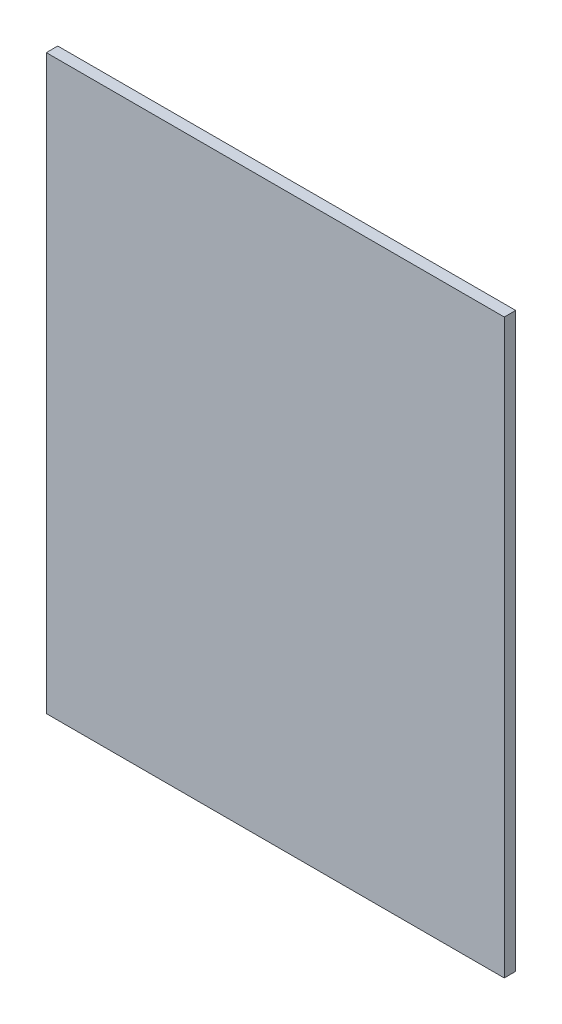
ISO-10303-21;
HEADER;
FILE_DESCRIPTION(('STEP AP214'),'2;1');
FILE_NAME('part.step','',(''),(''),'','','');
FILE_SCHEMA(('AUTOMOTIVE_DESIGN { 1 0 10303 214 1 1 1 1 }'));
ENDSEC;
DATA;
#1=APPLICATION_CONTEXT('core data for automotive mechanical design processes');
#2=APPLICATION_PROTOCOL_DEFINITION('international standard','automotive_design',2000,#1);
#3=PRODUCT_CONTEXT('',#1,'mechanical');
#4=PRODUCT('Part','Part','',(#3));
#5=PRODUCT_RELATED_PRODUCT_CATEGORY('part','',(#4));
#6=PRODUCT_DEFINITION_FORMATION('','',#4);
#7=PRODUCT_DEFINITION_CONTEXT('part definition',#1,'design');
#8=PRODUCT_DEFINITION('design','',#6,#7);
#9=PRODUCT_DEFINITION_SHAPE('','',#8);
#10=(LENGTH_UNIT() NAMED_UNIT(*) SI_UNIT(.MILLI.,.METRE.));
#11=(NAMED_UNIT(*) PLANE_ANGLE_UNIT() SI_UNIT($,.RADIAN.));
#12=(NAMED_UNIT(*) SI_UNIT($,.STERADIAN.) SOLID_ANGLE_UNIT());
#13=UNCERTAINTY_MEASURE_WITH_UNIT(LENGTH_MEASURE(1.E-05),#10,'distance_accuracy_value','');
#14=(GEOMETRIC_REPRESENTATION_CONTEXT(3) GLOBAL_UNCERTAINTY_ASSIGNED_CONTEXT((#13)) GLOBAL_UNIT_ASSIGNED_CONTEXT((#10,
#11,#12)) REPRESENTATION_CONTEXT('',''));
#15=CARTESIAN_POINT('',(0.,0.,0.));
#16=DIRECTION('',(0.,0.,1.));
#17=DIRECTION('',(1.,0.,0.));
#18=AXIS2_PLACEMENT_3D('',#15,#16,#17);
#19=CARTESIAN_POINT('',(0.,0.,3.));
#20=DIRECTION('',(1.,0.,0.));
#21=DIRECTION('',(0.,0.,-1.));
#22=AXIS2_PLACEMENT_3D('',#19,#20,#21);
#23=PLANE('',#22);
#24=DIRECTION('',(0.,-1.,0.));
#25=VECTOR('',#24,1.);
#26=CARTESIAN_POINT('',(0.,0.,0.));
#27=LINE('',#26,#25);
#28=CARTESIAN_POINT('',(0.,150.,0.));
#29=VERTEX_POINT('',#28);
#30=CARTESIAN_POINT('',(0.,0.,0.));
#31=VERTEX_POINT('',#30);
#32=EDGE_CURVE('E96',#29,#31,#27,.T.);
#33=ORIENTED_EDGE('',*,*,#32,.T.);
#34=DIRECTION('',(0.,0.,-1.));
#35=VECTOR('',#34,1.);
#36=CARTESIAN_POINT('',(0.,0.,3.));
#37=LINE('',#36,#35);
#38=CARTESIAN_POINT('',(0.,0.,3.));
#39=VERTEX_POINT('',#38);
#40=EDGE_CURVE('E11',#39,#31,#37,.T.);
#41=ORIENTED_EDGE('',*,*,#40,.F.);
#42=DIRECTION('',(0.,-1.,0.));
#43=VECTOR('',#42,1.);
#44=CARTESIAN_POINT('',(0.,0.,3.));
#45=LINE('',#44,#43);
#46=CARTESIAN_POINT('',(0.,150.,3.));
#47=VERTEX_POINT('',#46);
#48=EDGE_CURVE('E84',#47,#39,#45,.T.);
#49=ORIENTED_EDGE('',*,*,#48,.F.);
#50=DIRECTION('',(0.,0.,-1.));
#51=VECTOR('',#50,1.);
#52=CARTESIAN_POINT('',(0.,150.,3.));
#53=LINE('',#52,#51);
#54=EDGE_CURVE('E92',#47,#29,#53,.T.);
#55=ORIENTED_EDGE('',*,*,#54,.T.);
#56=EDGE_LOOP('',(#33,#41,#49,#55));
#57=FACE_BOUND('',#56,.T.);
#58=ADVANCED_FACE('F33',(#57),#23,.F.);
#59=CARTESIAN_POINT('',(0.,0.,3.));
#60=DIRECTION('',(0.,1.,0.));
#61=DIRECTION('',(0.,0.,1.));
#62=AXIS2_PLACEMENT_3D('',#59,#60,#61);
#63=PLANE('',#62);
#64=DIRECTION('',(1.,0.,0.));
#65=VECTOR('',#64,1.);
#66=CARTESIAN_POINT('',(0.,0.,0.));
#67=LINE('',#66,#65);
#68=CARTESIAN_POINT('',(120.,0.,0.));
#69=VERTEX_POINT('',#68);
#70=EDGE_CURVE('E88',#31,#69,#67,.T.);
#71=ORIENTED_EDGE('',*,*,#70,.T.);
#72=DIRECTION('',(0.,0.,-1.));
#73=VECTOR('',#72,1.);
#74=CARTESIAN_POINT('',(120.,0.,3.));
#75=LINE('',#74,#73);
#76=CARTESIAN_POINT('',(120.,0.,3.));
#77=VERTEX_POINT('',#76);
#78=EDGE_CURVE('E41',#77,#69,#75,.T.);
#79=ORIENTED_EDGE('',*,*,#78,.F.);
#80=DIRECTION('',(1.,0.,0.));
#81=VECTOR('',#80,1.);
#82=CARTESIAN_POINT('',(0.,0.,3.));
#83=LINE('',#82,#81);
#84=EDGE_CURVE('E79',#39,#77,#83,.T.);
#85=ORIENTED_EDGE('',*,*,#84,.F.);
#86=ORIENTED_EDGE('',*,*,#40,.T.);
#87=EDGE_LOOP('',(#71,#79,#85,#86));
#88=FACE_BOUND('',#87,.T.);
#89=ADVANCED_FACE('F87',(#88),#63,.F.);
#90=CARTESIAN_POINT('',(120.,0.,3.));
#91=DIRECTION('',(-1.,0.,0.));
#92=DIRECTION('',(0.,0.,1.));
#93=AXIS2_PLACEMENT_3D('',#90,#91,#92);
#94=PLANE('',#93);
#95=DIRECTION('',(0.,1.,0.));
#96=VECTOR('',#95,1.);
#97=CARTESIAN_POINT('',(120.,0.,0.));
#98=LINE('',#97,#96);
#99=CARTESIAN_POINT('',(120.,150.,0.));
#100=VERTEX_POINT('',#99);
#101=EDGE_CURVE('E66',#69,#100,#98,.T.);
#102=ORIENTED_EDGE('',*,*,#101,.T.);
#103=DIRECTION('',(0.,0.,-1.));
#104=VECTOR('',#103,1.);
#105=CARTESIAN_POINT('',(120.,150.,3.));
#106=LINE('',#105,#104);
#107=CARTESIAN_POINT('',(120.,150.,3.));
#108=VERTEX_POINT('',#107);
#109=EDGE_CURVE('E89',#108,#100,#106,.T.);
#110=ORIENTED_EDGE('',*,*,#109,.F.);
#111=DIRECTION('',(0.,1.,0.));
#112=VECTOR('',#111,1.);
#113=CARTESIAN_POINT('',(120.,0.,3.));
#114=LINE('',#113,#112);
#115=EDGE_CURVE('E82',#77,#108,#114,.T.);
#116=ORIENTED_EDGE('',*,*,#115,.F.);
#117=ORIENTED_EDGE('',*,*,#78,.T.);
#118=EDGE_LOOP('',(#102,#110,#116,#117));
#119=FACE_BOUND('',#118,.T.);
#120=ADVANCED_FACE('F90',(#119),#94,.F.);
#121=CARTESIAN_POINT('',(0.,150.,3.));
#122=DIRECTION('',(0.,-1.,0.));
#123=DIRECTION('',(0.,0.,-1.));
#124=AXIS2_PLACEMENT_3D('',#121,#122,#123);
#125=PLANE('',#124);
#126=DIRECTION('',(-1.,0.,0.));
#127=VECTOR('',#126,1.);
#128=CARTESIAN_POINT('',(0.,150.,0.));
#129=LINE('',#128,#127);
#130=EDGE_CURVE('E72',#100,#29,#129,.T.);
#131=ORIENTED_EDGE('',*,*,#130,.T.);
#132=ORIENTED_EDGE('',*,*,#54,.F.);
#133=DIRECTION('',(-1.,0.,0.));
#134=VECTOR('',#133,1.);
#135=CARTESIAN_POINT('',(0.,150.,3.));
#136=LINE('',#135,#134);
#137=EDGE_CURVE('E49',#108,#47,#136,.T.);
#138=ORIENTED_EDGE('',*,*,#137,.F.);
#139=ORIENTED_EDGE('',*,*,#109,.T.);
#140=EDGE_LOOP('',(#131,#132,#138,#139));
#141=FACE_BOUND('',#140,.T.);
#142=ADVANCED_FACE('F103',(#141),#125,.F.);
#143=CARTESIAN_POINT('',(0.,0.,3.));
#144=DIRECTION('',(0.,0.,-1.));
#145=DIRECTION('',(-1.,0.,0.));
#146=AXIS2_PLACEMENT_3D('',#143,#144,#145);
#147=PLANE('',#146);
#148=ORIENTED_EDGE('',*,*,#48,.T.);
#149=ORIENTED_EDGE('',*,*,#84,.T.);
#150=ORIENTED_EDGE('',*,*,#115,.T.);
#151=ORIENTED_EDGE('',*,*,#137,.T.);
#152=EDGE_LOOP('',(#148,#149,#150,#151));
#153=FACE_BOUND('',#152,.T.);
#154=ADVANCED_FACE('F80',(#153),#147,.F.);
#155=CARTESIAN_POINT('',(0.,0.,0.));
#156=DIRECTION('',(0.,0.,-1.));
#157=DIRECTION('',(-1.,0.,0.));
#158=AXIS2_PLACEMENT_3D('',#155,#156,#157);
#159=PLANE('',#158);
#160=ORIENTED_EDGE('',*,*,#32,.F.);
#161=ORIENTED_EDGE('',*,*,#130,.F.);
#162=ORIENTED_EDGE('',*,*,#101,.F.);
#163=ORIENTED_EDGE('',*,*,#70,.F.);
#164=EDGE_LOOP('',(#160,#161,#162,#163));
#165=FACE_BOUND('',#164,.T.);
#166=ADVANCED_FACE('F106',(#165),#159,.T.);
#167=CLOSED_SHELL('',(#58,#89,#120,#142,#154,#166));
#168=MANIFOLD_SOLID_BREP('B2',#167);
#169=ADVANCED_BREP_SHAPE_REPRESENTATION('',(#18,#168),#14);
#170=SHAPE_DEFINITION_REPRESENTATION(#9,#169);
ENDSEC;
END-ISO-10303-21;
